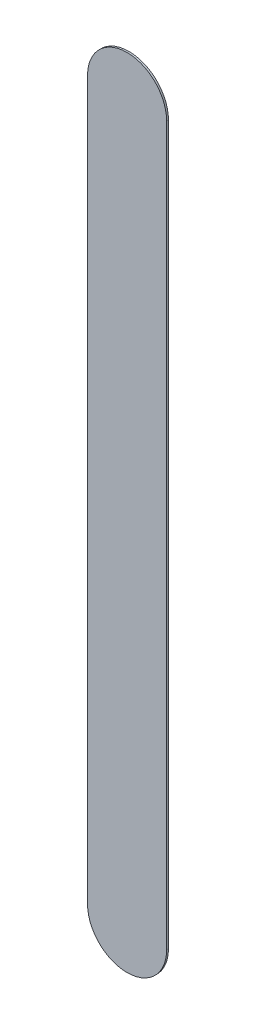
ISO-10303-21;
HEADER;
FILE_DESCRIPTION(('STEP AP214'),'2;1');
FILE_NAME('part.step','',(''),(''),'','','');
FILE_SCHEMA(('AUTOMOTIVE_DESIGN { 1 0 10303 214 1 1 1 1 }'));
ENDSEC;
DATA;
#1=APPLICATION_CONTEXT('core data for automotive mechanical design processes');
#2=APPLICATION_PROTOCOL_DEFINITION('international standard','automotive_design',2000,#1);
#3=PRODUCT_CONTEXT('',#1,'mechanical');
#4=PRODUCT('Part','Part','',(#3));
#5=PRODUCT_RELATED_PRODUCT_CATEGORY('part','',(#4));
#6=PRODUCT_DEFINITION_FORMATION('','',#4);
#7=PRODUCT_DEFINITION_CONTEXT('part definition',#1,'design');
#8=PRODUCT_DEFINITION('design','',#6,#7);
#9=PRODUCT_DEFINITION_SHAPE('','',#8);
#10=(LENGTH_UNIT() NAMED_UNIT(*) SI_UNIT(.MILLI.,.METRE.));
#11=(NAMED_UNIT(*) PLANE_ANGLE_UNIT() SI_UNIT($,.RADIAN.));
#12=(NAMED_UNIT(*) SI_UNIT($,.STERADIAN.) SOLID_ANGLE_UNIT());
#13=UNCERTAINTY_MEASURE_WITH_UNIT(LENGTH_MEASURE(1.E-05),#10,'distance_accuracy_value','');
#14=(GEOMETRIC_REPRESENTATION_CONTEXT(3) GLOBAL_UNCERTAINTY_ASSIGNED_CONTEXT((#13)) GLOBAL_UNIT_ASSIGNED_CONTEXT((#10,
#11,#12)) REPRESENTATION_CONTEXT('',''));
#15=CARTESIAN_POINT('',(0.,0.,0.));
#16=DIRECTION('',(0.,0.,1.));
#17=DIRECTION('',(1.,0.,0.));
#18=AXIS2_PLACEMENT_3D('',#15,#16,#17);
#19=CARTESIAN_POINT('',(160.794,-128.626,0.));
#20=DIRECTION('',(0.,0.,1.));
#21=DIRECTION('',(1.,0.,0.));
#22=AXIS2_PLACEMENT_3D('',#19,#20,#21);
#23=PLANE('',#22);
#24=DIRECTION('',(0.,-1.,0.));
#25=VECTOR('',#24,1.);
#26=CARTESIAN_POINT('',(160.794,-128.626,0.));
#27=LINE('',#26,#25);
#28=CARTESIAN_POINT('',(160.794,-128.626,0.));
#29=VERTEX_POINT('',#28);
#30=CARTESIAN_POINT('',(160.794,-142.24,0.));
#31=VERTEX_POINT('',#30);
#32=EDGE_CURVE('E94',#29,#31,#27,.T.);
#33=ORIENTED_EDGE('',*,*,#32,.T.);
#34=CARTESIAN_POINT('',(161.544,-142.24,0.));
#35=DIRECTION('',(0.,0.,1.));
#36=DIRECTION('',(-1.,0.,0.));
#37=AXIS2_PLACEMENT_3D('',#34,#35,#36);
#38=CIRCLE('',#37,0.75);
#39=CARTESIAN_POINT('',(162.294,-142.24,0.));
#40=VERTEX_POINT('',#39);
#41=EDGE_CURVE('E72',#31,#40,#38,.T.);
#42=ORIENTED_EDGE('',*,*,#41,.T.);
#43=DIRECTION('',(0.,1.,0.));
#44=VECTOR('',#43,1.);
#45=CARTESIAN_POINT('',(162.294,-142.24,0.));
#46=LINE('',#45,#44);
#47=CARTESIAN_POINT('',(162.294,-128.626,0.));
#48=VERTEX_POINT('',#47);
#49=EDGE_CURVE('E77',#40,#48,#46,.T.);
#50=ORIENTED_EDGE('',*,*,#49,.T.);
#51=CARTESIAN_POINT('',(161.544,-128.626,0.));
#52=DIRECTION('',(0.,0.,1.));
#53=DIRECTION('',(1.,0.,0.));
#54=AXIS2_PLACEMENT_3D('',#51,#52,#53);
#55=CIRCLE('',#54,0.75);
#56=EDGE_CURVE('E11',#48,#29,#55,.T.);
#57=ORIENTED_EDGE('',*,*,#56,.T.);
#58=EDGE_LOOP('',(#33,#42,#50,#57));
#59=FACE_BOUND('',#58,.T.);
#60=ADVANCED_FACE('F17',(#59),#23,.T.);
#61=CARTESIAN_POINT('',(160.794,-128.626,-0.035));
#62=DIRECTION('',(0.,0.,1.));
#63=DIRECTION('',(1.,0.,0.));
#64=AXIS2_PLACEMENT_3D('',#61,#62,#63);
#65=PLANE('',#64);
#66=CARTESIAN_POINT('',(161.544,-128.626,-0.035));
#67=DIRECTION('',(0.,0.,1.));
#68=DIRECTION('',(1.,0.,0.));
#69=AXIS2_PLACEMENT_3D('',#66,#67,#68);
#70=CIRCLE('',#69,0.75);
#71=CARTESIAN_POINT('',(162.294,-128.626,-0.035));
#72=VERTEX_POINT('',#71);
#73=CARTESIAN_POINT('',(160.794,-128.626,-0.035));
#74=VERTEX_POINT('',#73);
#75=EDGE_CURVE('E26',#72,#74,#70,.T.);
#76=ORIENTED_EDGE('',*,*,#75,.F.);
#77=DIRECTION('',(0.,1.,0.));
#78=VECTOR('',#77,1.);
#79=CARTESIAN_POINT('',(162.294,-142.24,-0.035));
#80=LINE('',#79,#78);
#81=CARTESIAN_POINT('',(162.294,-142.24,-0.035));
#82=VERTEX_POINT('',#81);
#83=EDGE_CURVE('E63',#82,#72,#80,.T.);
#84=ORIENTED_EDGE('',*,*,#83,.F.);
#85=CARTESIAN_POINT('',(161.544,-142.24,-0.035));
#86=DIRECTION('',(0.,0.,1.));
#87=DIRECTION('',(-1.,0.,0.));
#88=AXIS2_PLACEMENT_3D('',#85,#86,#87);
#89=CIRCLE('',#88,0.75);
#90=CARTESIAN_POINT('',(160.794,-142.24,-0.035));
#91=VERTEX_POINT('',#90);
#92=EDGE_CURVE('E67',#91,#82,#89,.T.);
#93=ORIENTED_EDGE('',*,*,#92,.F.);
#94=DIRECTION('',(0.,-1.,0.));
#95=VECTOR('',#94,1.);
#96=CARTESIAN_POINT('',(160.794,-128.626,-0.035));
#97=LINE('',#96,#95);
#98=EDGE_CURVE('E116',#74,#91,#97,.T.);
#99=ORIENTED_EDGE('',*,*,#98,.F.);
#100=EDGE_LOOP('',(#76,#84,#93,#99));
#101=FACE_BOUND('',#100,.T.);
#102=ADVANCED_FACE('F65',(#101),#65,.F.);
#103=CARTESIAN_POINT('',(161.544,-128.626,-0.035));
#104=DIRECTION('',(0.,0.,-1.));
#105=DIRECTION('',(1.,0.,0.));
#106=AXIS2_PLACEMENT_3D('',#103,#104,#105);
#107=CYLINDRICAL_SURFACE('',#106,0.75);
#108=ORIENTED_EDGE('',*,*,#75,.T.);
#109=DIRECTION('',(0.,0.,1.));
#110=VECTOR('',#109,1.);
#111=CARTESIAN_POINT('',(160.794,-128.626,-0.035));
#112=LINE('',#111,#110);
#113=EDGE_CURVE('E88',#74,#29,#112,.T.);
#114=ORIENTED_EDGE('',*,*,#113,.T.);
#115=ORIENTED_EDGE('',*,*,#56,.F.);
#116=DIRECTION('',(0.,0.,1.));
#117=VECTOR('',#116,1.);
#118=CARTESIAN_POINT('',(162.294,-128.626,-0.035));
#119=LINE('',#118,#117);
#120=EDGE_CURVE('E20',#72,#48,#119,.T.);
#121=ORIENTED_EDGE('',*,*,#120,.F.);
#122=EDGE_LOOP('',(#108,#114,#115,#121));
#123=FACE_BOUND('',#122,.T.);
#124=ADVANCED_FACE('F113',(#123),#107,.T.);
#125=CARTESIAN_POINT('',(162.294,-142.24,-0.035));
#126=DIRECTION('',(-1.,0.,0.));
#127=DIRECTION('',(0.,0.,1.));
#128=AXIS2_PLACEMENT_3D('',#125,#126,#127);
#129=PLANE('',#128);
#130=ORIENTED_EDGE('',*,*,#83,.T.);
#131=ORIENTED_EDGE('',*,*,#120,.T.);
#132=ORIENTED_EDGE('',*,*,#49,.F.);
#133=DIRECTION('',(0.,0.,1.));
#134=VECTOR('',#133,1.);
#135=CARTESIAN_POINT('',(162.294,-142.24,-0.035));
#136=LINE('',#135,#134);
#137=EDGE_CURVE('E75',#82,#40,#136,.T.);
#138=ORIENTED_EDGE('',*,*,#137,.F.);
#139=EDGE_LOOP('',(#130,#131,#132,#138));
#140=FACE_BOUND('',#139,.T.);
#141=ADVANCED_FACE('F76',(#140),#129,.F.);
#142=CARTESIAN_POINT('',(161.544,-142.24,-0.035));
#143=DIRECTION('',(0.,0.,-1.));
#144=DIRECTION('',(-1.,0.,0.));
#145=AXIS2_PLACEMENT_3D('',#142,#143,#144);
#146=CYLINDRICAL_SURFACE('',#145,0.75);
#147=ORIENTED_EDGE('',*,*,#92,.T.);
#148=ORIENTED_EDGE('',*,*,#137,.T.);
#149=ORIENTED_EDGE('',*,*,#41,.F.);
#150=DIRECTION('',(0.,0.,1.));
#151=VECTOR('',#150,1.);
#152=CARTESIAN_POINT('',(160.794,-142.24,-0.035));
#153=LINE('',#152,#151);
#154=EDGE_CURVE('E85',#91,#31,#153,.T.);
#155=ORIENTED_EDGE('',*,*,#154,.F.);
#156=EDGE_LOOP('',(#147,#148,#149,#155));
#157=FACE_BOUND('',#156,.T.);
#158=ADVANCED_FACE('F83',(#157),#146,.T.);
#159=CARTESIAN_POINT('',(160.794,-128.626,-0.035));
#160=DIRECTION('',(1.,0.,0.));
#161=DIRECTION('',(0.,1.,0.));
#162=AXIS2_PLACEMENT_3D('',#159,#160,#161);
#163=PLANE('',#162);
#164=ORIENTED_EDGE('',*,*,#98,.T.);
#165=ORIENTED_EDGE('',*,*,#154,.T.);
#166=ORIENTED_EDGE('',*,*,#32,.F.);
#167=ORIENTED_EDGE('',*,*,#113,.F.);
#168=EDGE_LOOP('',(#164,#165,#166,#167));
#169=FACE_BOUND('',#168,.T.);
#170=ADVANCED_FACE('F115',(#169),#163,.F.);
#171=CLOSED_SHELL('',(#60,#102,#124,#141,#158,#170));
#172=MANIFOLD_SOLID_BREP('B1',#171);
#173=ADVANCED_BREP_SHAPE_REPRESENTATION('',(#18,#172),#14);
#174=SHAPE_DEFINITION_REPRESENTATION(#9,#173);
ENDSEC;
END-ISO-10303-21;
